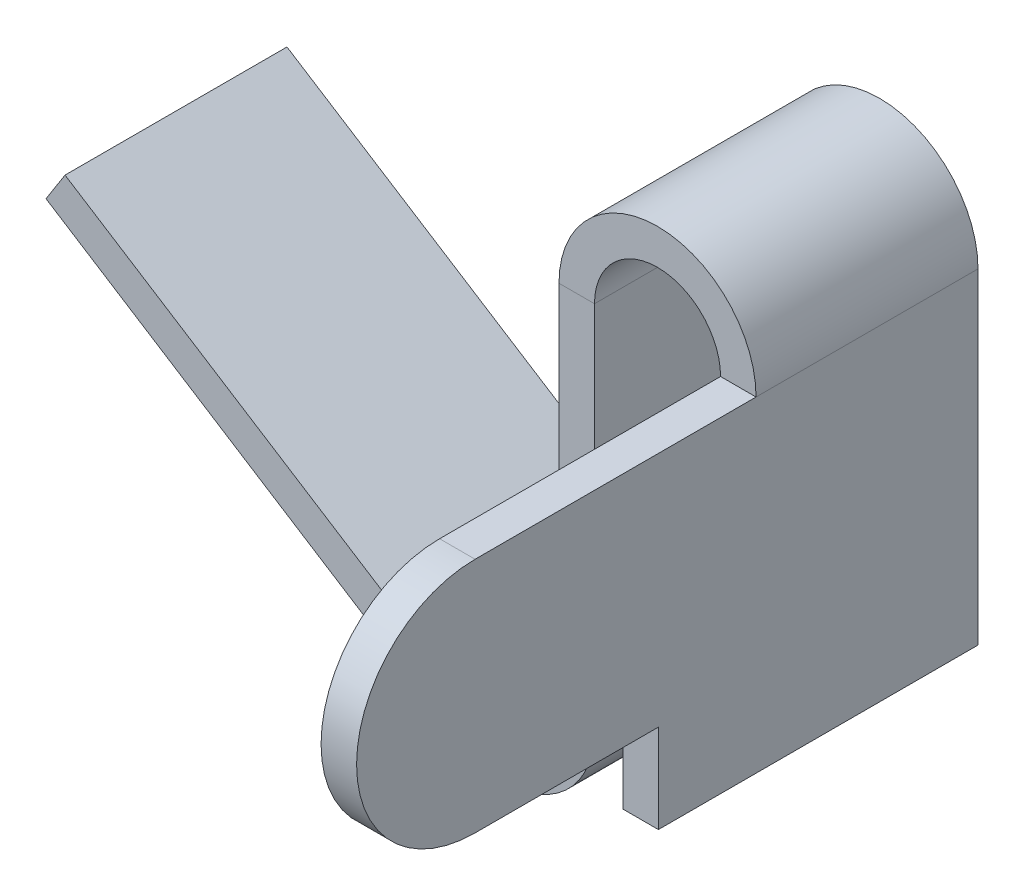
ISO-10303-21;
HEADER;
FILE_DESCRIPTION(('STEP AP214'),'2;1');
FILE_NAME('part.step','',(''),(''),'','','');
FILE_SCHEMA(('AUTOMOTIVE_DESIGN { 1 0 10303 214 1 1 1 1 }'));
ENDSEC;
DATA;
#1=APPLICATION_CONTEXT('core data for automotive mechanical design processes');
#2=APPLICATION_PROTOCOL_DEFINITION('international standard','automotive_design',2000,#1);
#3=PRODUCT_CONTEXT('',#1,'mechanical');
#4=PRODUCT('Part','Part','',(#3));
#5=PRODUCT_RELATED_PRODUCT_CATEGORY('part','',(#4));
#6=PRODUCT_DEFINITION_FORMATION('','',#4);
#7=PRODUCT_DEFINITION_CONTEXT('part definition',#1,'design');
#8=PRODUCT_DEFINITION('design','',#6,#7);
#9=PRODUCT_DEFINITION_SHAPE('','',#8);
#10=(LENGTH_UNIT() NAMED_UNIT(*) SI_UNIT(.MILLI.,.METRE.));
#11=(NAMED_UNIT(*) PLANE_ANGLE_UNIT() SI_UNIT($,.RADIAN.));
#12=(NAMED_UNIT(*) SI_UNIT($,.STERADIAN.) SOLID_ANGLE_UNIT());
#13=UNCERTAINTY_MEASURE_WITH_UNIT(LENGTH_MEASURE(1.E-05),#10,'distance_accuracy_value','');
#14=(GEOMETRIC_REPRESENTATION_CONTEXT(3) GLOBAL_UNCERTAINTY_ASSIGNED_CONTEXT((#13)) GLOBAL_UNIT_ASSIGNED_CONTEXT((#10,
#11,#12)) REPRESENTATION_CONTEXT('',''));
#15=CARTESIAN_POINT('',(0.,0.,0.));
#16=DIRECTION('',(0.,0.,1.));
#17=DIRECTION('',(1.,0.,0.));
#18=AXIS2_PLACEMENT_3D('',#15,#16,#17);
#19=CARTESIAN_POINT('',(1.11,0.5,5.665));
#20=DIRECTION('',(-1.,0.,0.));
#21=DIRECTION('',(0.,-1.,0.));
#22=AXIS2_PLACEMENT_3D('',#19,#20,#21);
#23=CYLINDRICAL_SURFACE('',#22,1.335);
#24=DIRECTION('',(1.,0.,0.));
#25=VECTOR('',#24,1.);
#26=CARTESIAN_POINT('',(1.11,-0.835,5.665));
#27=LINE('',#26,#25);
#28=CARTESIAN_POINT('',(1.11,-0.835,5.665));
#29=VERTEX_POINT('',#28);
#30=CARTESIAN_POINT('',(0.71,-0.835,5.665));
#31=VERTEX_POINT('',#30);
#32=EDGE_CURVE('E282',#29,#31,#27,.F.);
#33=ORIENTED_EDGE('',*,*,#32,.F.);
#34=CARTESIAN_POINT('',(1.11,0.5,5.665));
#35=DIRECTION('',(-1.,0.,0.));
#36=DIRECTION('',(0.,-1.,0.));
#37=AXIS2_PLACEMENT_3D('',#34,#35,#36);
#38=CIRCLE('',#37,1.335);
#39=CARTESIAN_POINT('',(1.11,1.835,5.665));
#40=VERTEX_POINT('',#39);
#41=EDGE_CURVE('E45',#40,#29,#38,.F.);
#42=ORIENTED_EDGE('',*,*,#41,.F.);
#43=DIRECTION('',(1.,0.,0.));
#44=VECTOR('',#43,1.);
#45=CARTESIAN_POINT('',(1.11,1.835,5.665));
#46=LINE('',#45,#44);
#47=CARTESIAN_POINT('',(0.71,1.835,5.665));
#48=VERTEX_POINT('',#47);
#49=EDGE_CURVE('E284',#48,#40,#46,.T.);
#50=ORIENTED_EDGE('',*,*,#49,.F.);
#51=CARTESIAN_POINT('',(0.71,0.5,5.665));
#52=DIRECTION('',(-1.,0.,0.));
#53=DIRECTION('',(0.,-1.,0.));
#54=AXIS2_PLACEMENT_3D('',#51,#52,#53);
#55=CIRCLE('',#54,1.335);
#56=EDGE_CURVE('E11',#31,#48,#55,.T.);
#57=ORIENTED_EDGE('',*,*,#56,.F.);
#58=EDGE_LOOP('',(#33,#42,#50,#57));
#59=FACE_BOUND('',#58,.T.);
#60=ADVANCED_FACE('F37',(#59),#23,.T.);
#61=CARTESIAN_POINT('',(-0.71,1.835,2.5));
#62=DIRECTION('',(0.,0.,1.));
#63=DIRECTION('',(1.,0.,0.));
#64=AXIS2_PLACEMENT_3D('',#61,#62,#63);
#65=PLANE('',#64);
#66=DIRECTION('',(-1.,0.,0.));
#67=VECTOR('',#66,1.);
#68=CARTESIAN_POINT('',(-0.71,1.835,2.5));
#69=LINE('',#68,#67);
#70=CARTESIAN_POINT('',(-0.71,1.835,2.5));
#71=VERTEX_POINT('',#70);
#72=CARTESIAN_POINT('',(-1.11,1.835,2.5));
#73=VERTEX_POINT('',#72);
#74=EDGE_CURVE('E280',#71,#73,#69,.T.);
#75=ORIENTED_EDGE('',*,*,#74,.F.);
#76=CARTESIAN_POINT('',(0.,1.835,2.5));
#77=DIRECTION('',(0.,0.,1.));
#78=DIRECTION('',(1.,0.,0.));
#79=AXIS2_PLACEMENT_3D('',#76,#77,#78);
#80=CIRCLE('',#79,0.71);
#81=CARTESIAN_POINT('',(0.71,1.835,2.5));
#82=VERTEX_POINT('',#81);
#83=EDGE_CURVE('E187',#82,#71,#80,.T.);
#84=ORIENTED_EDGE('',*,*,#83,.F.);
#85=DIRECTION('',(-1.,0.,0.));
#86=VECTOR('',#85,1.);
#87=CARTESIAN_POINT('',(1.11,1.835,2.5));
#88=LINE('',#87,#86);
#89=CARTESIAN_POINT('',(1.11,1.835,2.5));
#90=VERTEX_POINT('',#89);
#91=EDGE_CURVE('E277',#90,#82,#88,.T.);
#92=ORIENTED_EDGE('',*,*,#91,.F.);
#93=CARTESIAN_POINT('',(0.,1.835,2.5));
#94=DIRECTION('',(0.,0.,1.));
#95=DIRECTION('',(1.,0.,0.));
#96=AXIS2_PLACEMENT_3D('',#93,#94,#95);
#97=CIRCLE('',#96,1.11);
#98=EDGE_CURVE('E190',#90,#73,#97,.T.);
#99=ORIENTED_EDGE('',*,*,#98,.T.);
#100=EDGE_LOOP('',(#75,#84,#92,#99));
#101=FACE_BOUND('',#100,.T.);
#102=ADVANCED_FACE('F298',(#101),#65,.T.);
#103=CARTESIAN_POINT('',(1.11,1.835,2.5));
#104=DIRECTION('',(0.,0.,1.));
#105=DIRECTION('',(1.,0.,0.));
#106=AXIS2_PLACEMENT_3D('',#103,#104,#105);
#107=PLANE('',#106);
#108=DIRECTION('',(0.,-1.,0.));
#109=VECTOR('',#108,1.);
#110=CARTESIAN_POINT('',(-0.71,-1.835,2.5));
#111=LINE('',#110,#109);
#112=CARTESIAN_POINT('',(-0.71,-2.335,2.5));
#113=VERTEX_POINT('',#112);
#114=EDGE_CURVE('E184',#71,#113,#111,.T.);
#115=ORIENTED_EDGE('',*,*,#114,.F.);
#116=ORIENTED_EDGE('',*,*,#74,.T.);
#117=DIRECTION('',(0.,-1.,0.));
#118=VECTOR('',#117,1.);
#119=CARTESIAN_POINT('',(-1.11,-1.835,2.5));
#120=LINE('',#119,#118);
#121=CARTESIAN_POINT('',(-1.11,-2.335,2.5));
#122=VERTEX_POINT('',#121);
#123=EDGE_CURVE('E193',#73,#122,#120,.T.);
#124=ORIENTED_EDGE('',*,*,#123,.T.);
#125=DIRECTION('',(1.,0.,0.));
#126=VECTOR('',#125,1.);
#127=CARTESIAN_POINT('',(-1.11,-2.335,2.5));
#128=LINE('',#127,#126);
#129=EDGE_CURVE('E269',#122,#113,#128,.T.);
#130=ORIENTED_EDGE('',*,*,#129,.T.);
#131=EDGE_LOOP('',(#115,#116,#124,#130));
#132=FACE_BOUND('',#131,.T.);
#133=ADVANCED_FACE('F325',(#132),#107,.T.);
#134=CARTESIAN_POINT('',(0.71,1.835,0.));
#135=DIRECTION('',(0.,0.,-1.));
#136=DIRECTION('',(-1.,0.,0.));
#137=AXIS2_PLACEMENT_3D('',#134,#135,#136);
#138=PLANE('',#137);
#139=DIRECTION('',(1.,0.,0.));
#140=VECTOR('',#139,1.);
#141=CARTESIAN_POINT('',(0.71,1.835,0.));
#142=LINE('',#141,#140);
#143=CARTESIAN_POINT('',(0.71,1.835,0.));
#144=VERTEX_POINT('',#143);
#145=CARTESIAN_POINT('',(1.11,1.835,0.));
#146=VERTEX_POINT('',#145);
#147=EDGE_CURVE('E275',#144,#146,#142,.T.);
#148=ORIENTED_EDGE('',*,*,#147,.F.);
#149=CARTESIAN_POINT('',(0.,1.835,0.));
#150=DIRECTION('',(0.,0.,1.));
#151=DIRECTION('',(1.,0.,0.));
#152=AXIS2_PLACEMENT_3D('',#149,#150,#151);
#153=CIRCLE('',#152,0.71);
#154=CARTESIAN_POINT('',(-0.71,1.835,0.));
#155=VERTEX_POINT('',#154);
#156=EDGE_CURVE('E214',#144,#155,#153,.T.);
#157=ORIENTED_EDGE('',*,*,#156,.T.);
#158=DIRECTION('',(1.,0.,0.));
#159=VECTOR('',#158,1.);
#160=CARTESIAN_POINT('',(-1.11,1.835,0.));
#161=LINE('',#160,#159);
#162=CARTESIAN_POINT('',(-1.11,1.835,0.));
#163=VERTEX_POINT('',#162);
#164=EDGE_CURVE('E273',#163,#155,#161,.T.);
#165=ORIENTED_EDGE('',*,*,#164,.F.);
#166=CARTESIAN_POINT('',(0.,1.835,0.));
#167=DIRECTION('',(0.,0.,1.));
#168=DIRECTION('',(1.,0.,0.));
#169=AXIS2_PLACEMENT_3D('',#166,#167,#168);
#170=CIRCLE('',#169,1.11);
#171=EDGE_CURVE('E226',#146,#163,#170,.T.);
#172=ORIENTED_EDGE('',*,*,#171,.F.);
#173=EDGE_LOOP('',(#148,#157,#165,#172));
#174=FACE_BOUND('',#173,.T.);
#175=ADVANCED_FACE('F329',(#174),#138,.T.);
#176=CARTESIAN_POINT('',(-1.11,1.835,0.));
#177=DIRECTION('',(0.,0.,-1.));
#178=DIRECTION('',(-1.,0.,0.));
#179=AXIS2_PLACEMENT_3D('',#176,#177,#178);
#180=PLANE('',#179);
#181=DIRECTION('',(0.,1.,0.));
#182=VECTOR('',#181,1.);
#183=CARTESIAN_POINT('',(0.71,-1.835,0.));
#184=LINE('',#183,#182);
#185=CARTESIAN_POINT('',(0.71,-1.835,0.));
#186=VERTEX_POINT('',#185);
#187=EDGE_CURVE('E217',#186,#144,#184,.T.);
#188=ORIENTED_EDGE('',*,*,#187,.T.);
#189=ORIENTED_EDGE('',*,*,#147,.T.);
#190=DIRECTION('',(0.,1.,0.));
#191=VECTOR('',#190,1.);
#192=CARTESIAN_POINT('',(1.11,-1.835,0.));
#193=LINE('',#192,#191);
#194=CARTESIAN_POINT('',(1.11,-1.835,0.));
#195=VERTEX_POINT('',#194);
#196=EDGE_CURVE('E223',#195,#146,#193,.T.);
#197=ORIENTED_EDGE('',*,*,#196,.F.);
#198=DIRECTION('',(-1.,0.,0.));
#199=VECTOR('',#198,1.);
#200=CARTESIAN_POINT('',(1.11,-1.835,0.));
#201=LINE('',#200,#199);
#202=EDGE_CURVE('E220',#195,#186,#201,.T.);
#203=ORIENTED_EDGE('',*,*,#202,.T.);
#204=EDGE_LOOP('',(#188,#189,#197,#203));
#205=FACE_BOUND('',#204,.T.);
#206=ADVANCED_FACE('F310',(#205),#180,.T.);
#207=CARTESIAN_POINT('',(-2.24626881057681,-3.17904725152241,2.5));
#208=DIRECTION('',(0.,0.,1.));
#209=DIRECTION('',(1.,0.,0.));
#210=AXIS2_PLACEMENT_3D('',#207,#208,#209);
#211=PLANE('',#210);
#212=DIRECTION('',(0.536268810576813,0.844047251522407,0.));
#213=VECTOR('',#212,1.);
#214=CARTESIAN_POINT('',(-2.24626881057681,-3.17904725152241,2.5));
#215=LINE('',#214,#213);
#216=CARTESIAN_POINT('',(-2.24626881057681,-3.17904725152241,2.5));
#217=VERTEX_POINT('',#216);
#218=CARTESIAN_POINT('',(-2.03176128634609,-2.84142835091344,2.5));
#219=VERTEX_POINT('',#218);
#220=EDGE_CURVE('E271',#217,#219,#215,.T.);
#221=ORIENTED_EDGE('',*,*,#220,.F.);
#222=CARTESIAN_POINT('',(-1.71,-2.335,2.5));
#223=DIRECTION('',(0.,0.,-1.));
#224=DIRECTION('',(-1.,0.,0.));
#225=AXIS2_PLACEMENT_3D('',#222,#223,#224);
#226=CIRCLE('',#225,1.);
#227=EDGE_CURVE('E181',#113,#217,#226,.T.);
#228=ORIENTED_EDGE('',*,*,#227,.F.);
#229=ORIENTED_EDGE('',*,*,#129,.F.);
#230=CARTESIAN_POINT('',(-1.71,-2.335,2.5));
#231=DIRECTION('',(0.,0.,1.));
#232=DIRECTION('',(1.,0.,0.));
#233=AXIS2_PLACEMENT_3D('',#230,#231,#232);
#234=CIRCLE('',#233,0.6);
#235=EDGE_CURVE('E196',#122,#219,#234,.F.);
#236=ORIENTED_EDGE('',*,*,#235,.T.);
#237=EDGE_LOOP('',(#221,#228,#229,#236));
#238=FACE_BOUND('',#237,.T.);
#239=ADVANCED_FACE('F338',(#238),#211,.T.);
#240=CARTESIAN_POINT('',(-1.11,-2.335,2.5));
#241=DIRECTION('',(0.,0.,1.));
#242=DIRECTION('',(1.,0.,0.));
#243=AXIS2_PLACEMENT_3D('',#240,#241,#242);
#244=PLANE('',#243);
#245=DIRECTION('',(-0.844047251522407,0.536268810576813,0.));
#246=VECTOR('',#245,1.);
#247=CARTESIAN_POINT('',(-2.24626881057681,-3.17904725152241,2.5));
#248=LINE('',#247,#246);
#249=CARTESIAN_POINT('',(-6.88852869395005,-0.229568793349934,2.5));
#250=VERTEX_POINT('',#249);
#251=EDGE_CURVE('E178',#217,#250,#248,.T.);
#252=ORIENTED_EDGE('',*,*,#251,.F.);
#253=ORIENTED_EDGE('',*,*,#220,.T.);
#254=DIRECTION('',(-0.844047251522407,0.536268810576813,0.));
#255=VECTOR('',#254,1.);
#256=CARTESIAN_POINT('',(-2.03176128634609,-2.84142835091344,2.5));
#257=LINE('',#256,#255);
#258=CARTESIAN_POINT('',(-6.67402116971933,0.108050107259028,2.5));
#259=VERTEX_POINT('',#258);
#260=EDGE_CURVE('E172',#219,#259,#257,.T.);
#261=ORIENTED_EDGE('',*,*,#260,.T.);
#262=DIRECTION('',(0.536268810576813,0.844047251522408,0.));
#263=VECTOR('',#262,1.);
#264=CARTESIAN_POINT('',(-6.88852869395005,-0.229568793349934,2.5));
#265=LINE('',#264,#263);
#266=EDGE_CURVE('E174',#250,#259,#265,.T.);
#267=ORIENTED_EDGE('',*,*,#266,.F.);
#268=EDGE_LOOP('',(#252,#253,#261,#267));
#269=FACE_BOUND('',#268,.T.);
#270=ADVANCED_FACE('F341',(#269),#244,.T.);
#271=CARTESIAN_POINT('',(-0.71,-2.335,0.));
#272=DIRECTION('',(0.,0.,-1.));
#273=DIRECTION('',(-1.,0.,0.));
#274=AXIS2_PLACEMENT_3D('',#271,#272,#273);
#275=PLANE('',#274);
#276=DIRECTION('',(-1.,0.,0.));
#277=VECTOR('',#276,1.);
#278=CARTESIAN_POINT('',(-0.71,-2.335,0.));
#279=LINE('',#278,#277);
#280=CARTESIAN_POINT('',(-0.71,-2.335,0.));
#281=VERTEX_POINT('',#280);
#282=CARTESIAN_POINT('',(-1.11,-2.335,0.));
#283=VERTEX_POINT('',#282);
#284=EDGE_CURVE('E267',#281,#283,#279,.T.);
#285=ORIENTED_EDGE('',*,*,#284,.F.);
#286=CARTESIAN_POINT('',(-1.71,-2.335,0.));
#287=DIRECTION('',(0.,0.,-1.));
#288=DIRECTION('',(-1.,0.,0.));
#289=AXIS2_PLACEMENT_3D('',#286,#287,#288);
#290=CIRCLE('',#289,1.);
#291=CARTESIAN_POINT('',(-2.24626881057681,-3.17904725152241,0.));
#292=VERTEX_POINT('',#291);
#293=EDGE_CURVE('E208',#281,#292,#290,.T.);
#294=ORIENTED_EDGE('',*,*,#293,.T.);
#295=DIRECTION('',(-0.536268810576813,-0.844047251522407,0.));
#296=VECTOR('',#295,1.);
#297=CARTESIAN_POINT('',(-2.03176128634609,-2.84142835091344,0.));
#298=LINE('',#297,#296);
#299=CARTESIAN_POINT('',(-2.03176128634609,-2.84142835091344,0.));
#300=VERTEX_POINT('',#299);
#301=EDGE_CURVE('E265',#300,#292,#298,.T.);
#302=ORIENTED_EDGE('',*,*,#301,.F.);
#303=CARTESIAN_POINT('',(-1.71,-2.335,0.));
#304=DIRECTION('',(0.,0.,1.));
#305=DIRECTION('',(1.,0.,0.));
#306=AXIS2_PLACEMENT_3D('',#303,#304,#305);
#307=CIRCLE('',#306,0.6);
#308=EDGE_CURVE('E175',#283,#300,#307,.F.);
#309=ORIENTED_EDGE('',*,*,#308,.F.);
#310=EDGE_LOOP('',(#285,#294,#302,#309));
#311=FACE_BOUND('',#310,.T.);
#312=ADVANCED_FACE('F345',(#311),#275,.T.);
#313=CARTESIAN_POINT('',(-2.03176128634609,-2.84142835091344,0.));
#314=DIRECTION('',(0.,0.,-1.));
#315=DIRECTION('',(-1.,0.,0.));
#316=AXIS2_PLACEMENT_3D('',#313,#314,#315);
#317=PLANE('',#316);
#318=DIRECTION('',(0.,-1.,0.));
#319=VECTOR('',#318,1.);
#320=CARTESIAN_POINT('',(-0.71,-1.835,0.));
#321=LINE('',#320,#319);
#322=EDGE_CURVE('E211',#155,#281,#321,.T.);
#323=ORIENTED_EDGE('',*,*,#322,.T.);
#324=ORIENTED_EDGE('',*,*,#284,.T.);
#325=DIRECTION('',(0.,1.,0.));
#326=VECTOR('',#325,1.);
#327=CARTESIAN_POINT('',(-1.11,-1.835,0.));
#328=LINE('',#327,#326);
#329=EDGE_CURVE('E229',#163,#283,#328,.F.);
#330=ORIENTED_EDGE('',*,*,#329,.F.);
#331=ORIENTED_EDGE('',*,*,#164,.T.);
#332=EDGE_LOOP('',(#323,#324,#330,#331));
#333=FACE_BOUND('',#332,.T.);
#334=ADVANCED_FACE('F349',(#333),#317,.T.);
#335=CARTESIAN_POINT('',(-2.03176128634609,-2.84142835091344,2.5));
#336=DIRECTION('',(-0.536268810576813,-0.844047251522407,0.));
#337=DIRECTION('',(0.844047251522407,-0.536268810576813,0.));
#338=AXIS2_PLACEMENT_3D('',#335,#336,#337);
#339=PLANE('',#338);
#340=DIRECTION('',(-0.844047251522407,0.536268810576813,0.));
#341=VECTOR('',#340,1.);
#342=CARTESIAN_POINT('',(-2.03176128634609,-2.84142835091344,0.));
#343=LINE('',#342,#341);
#344=CARTESIAN_POINT('',(-6.67402116971933,0.108050107259028,0.));
#345=VERTEX_POINT('',#344);
#346=EDGE_CURVE('E171',#300,#345,#343,.T.);
#347=ORIENTED_EDGE('',*,*,#346,.T.);
#348=DIRECTION('',(0.,0.,-1.));
#349=VECTOR('',#348,1.);
#350=CARTESIAN_POINT('',(-6.67402116971933,0.108050107259028,2.5));
#351=LINE('',#350,#349);
#352=EDGE_CURVE('E263',#259,#345,#351,.T.);
#353=ORIENTED_EDGE('',*,*,#352,.F.);
#354=ORIENTED_EDGE('',*,*,#260,.F.);
#355=DIRECTION('',(0.,0.,-1.));
#356=VECTOR('',#355,1.);
#357=CARTESIAN_POINT('',(-2.03176128634609,-2.84142835091344,2.5));
#358=LINE('',#357,#356);
#359=EDGE_CURVE('E199',#219,#300,#358,.T.);
#360=ORIENTED_EDGE('',*,*,#359,.T.);
#361=EDGE_LOOP('',(#347,#353,#354,#360));
#362=FACE_BOUND('',#361,.T.);
#363=ADVANCED_FACE('F353',(#362),#339,.F.);
#364=CARTESIAN_POINT('',(-6.88852869395005,-0.229568793349934,2.5));
#365=DIRECTION('',(-0.844047251522408,0.536268810576813,0.));
#366=DIRECTION('',(-0.536268810576813,-0.844047251522408,0.));
#367=AXIS2_PLACEMENT_3D('',#364,#365,#366);
#368=PLANE('',#367);
#369=DIRECTION('',(0.536268810576813,0.844047251522408,0.));
#370=VECTOR('',#369,1.);
#371=CARTESIAN_POINT('',(-6.88852869395005,-0.229568793349934,0.));
#372=LINE('',#371,#370);
#373=CARTESIAN_POINT('',(-6.88852869395005,-0.229568793349934,0.));
#374=VERTEX_POINT('',#373);
#375=EDGE_CURVE('E202',#374,#345,#372,.T.);
#376=ORIENTED_EDGE('',*,*,#375,.F.);
#377=DIRECTION('',(0.,0.,-1.));
#378=VECTOR('',#377,1.);
#379=CARTESIAN_POINT('',(-6.88852869395005,-0.229568793349934,2.5));
#380=LINE('',#379,#378);
#381=EDGE_CURVE('E261',#250,#374,#380,.T.);
#382=ORIENTED_EDGE('',*,*,#381,.F.);
#383=ORIENTED_EDGE('',*,*,#266,.T.);
#384=ORIENTED_EDGE('',*,*,#352,.T.);
#385=EDGE_LOOP('',(#376,#382,#383,#384));
#386=FACE_BOUND('',#385,.T.);
#387=ADVANCED_FACE('F357',(#386),#368,.T.);
#388=CARTESIAN_POINT('',(-2.24626881057681,-3.17904725152241,2.5));
#389=DIRECTION('',(-0.536268810576813,-0.844047251522407,0.));
#390=DIRECTION('',(0.844047251522407,-0.536268810576813,0.));
#391=AXIS2_PLACEMENT_3D('',#388,#389,#390);
#392=PLANE('',#391);
#393=DIRECTION('',(-0.844047251522407,0.536268810576813,0.));
#394=VECTOR('',#393,1.);
#395=CARTESIAN_POINT('',(-2.24626881057681,-3.17904725152241,0.));
#396=LINE('',#395,#394);
#397=EDGE_CURVE('E205',#292,#374,#396,.T.);
#398=ORIENTED_EDGE('',*,*,#397,.F.);
#399=DIRECTION('',(0.,0.,-1.));
#400=VECTOR('',#399,1.);
#401=CARTESIAN_POINT('',(-2.24626881057681,-3.17904725152241,2.5));
#402=LINE('',#401,#400);
#403=EDGE_CURVE('E258',#217,#292,#402,.T.);
#404=ORIENTED_EDGE('',*,*,#403,.F.);
#405=ORIENTED_EDGE('',*,*,#251,.T.);
#406=ORIENTED_EDGE('',*,*,#381,.T.);
#407=EDGE_LOOP('',(#398,#404,#405,#406));
#408=FACE_BOUND('',#407,.T.);
#409=ADVANCED_FACE('F361',(#408),#392,.T.);
#410=CARTESIAN_POINT('',(-1.71,-2.335,2.5));
#411=DIRECTION('',(0.,0.,-1.));
#412=DIRECTION('',(-1.,0.,0.));
#413=AXIS2_PLACEMENT_3D('',#410,#411,#412);
#414=CYLINDRICAL_SURFACE('',#413,1.);
#415=ORIENTED_EDGE('',*,*,#293,.F.);
#416=DIRECTION('',(0.,0.,-1.));
#417=VECTOR('',#416,1.);
#418=CARTESIAN_POINT('',(-0.71,-2.335,2.5));
#419=LINE('',#418,#417);
#420=EDGE_CURVE('E255',#113,#281,#419,.T.);
#421=ORIENTED_EDGE('',*,*,#420,.F.);
#422=ORIENTED_EDGE('',*,*,#227,.T.);
#423=ORIENTED_EDGE('',*,*,#403,.T.);
#424=EDGE_LOOP('',(#415,#421,#422,#423));
#425=FACE_BOUND('',#424,.T.);
#426=ADVANCED_FACE('F365',(#425),#414,.T.);
#427=CARTESIAN_POINT('',(-0.71,-1.835,2.5));
#428=DIRECTION('',(1.,0.,0.));
#429=DIRECTION('',(0.,1.,0.));
#430=AXIS2_PLACEMENT_3D('',#427,#428,#429);
#431=PLANE('',#430);
#432=ORIENTED_EDGE('',*,*,#322,.F.);
#433=DIRECTION('',(0.,0.,-1.));
#434=VECTOR('',#433,1.);
#435=CARTESIAN_POINT('',(-0.71,1.835,2.5));
#436=LINE('',#435,#434);
#437=EDGE_CURVE('E252',#71,#155,#436,.T.);
#438=ORIENTED_EDGE('',*,*,#437,.F.);
#439=ORIENTED_EDGE('',*,*,#114,.T.);
#440=ORIENTED_EDGE('',*,*,#420,.T.);
#441=EDGE_LOOP('',(#432,#438,#439,#440));
#442=FACE_BOUND('',#441,.T.);
#443=ADVANCED_FACE('F369',(#442),#431,.T.);
#444=CARTESIAN_POINT('',(0.,1.835,2.5));
#445=DIRECTION('',(0.,0.,-1.));
#446=DIRECTION('',(-1.,0.,0.));
#447=AXIS2_PLACEMENT_3D('',#444,#445,#446);
#448=CYLINDRICAL_SURFACE('',#447,0.71);
#449=ORIENTED_EDGE('',*,*,#156,.F.);
#450=DIRECTION('',(0.,0.,-1.));
#451=VECTOR('',#450,1.);
#452=CARTESIAN_POINT('',(0.71,1.835,2.5));
#453=LINE('',#452,#451);
#454=EDGE_CURVE('E249',#82,#144,#453,.T.);
#455=ORIENTED_EDGE('',*,*,#454,.F.);
#456=ORIENTED_EDGE('',*,*,#83,.T.);
#457=ORIENTED_EDGE('',*,*,#437,.T.);
#458=EDGE_LOOP('',(#449,#455,#456,#457));
#459=FACE_BOUND('',#458,.T.);
#460=ADVANCED_FACE('F304',(#459),#448,.F.);
#461=CARTESIAN_POINT('',(0.71,-1.835,2.5));
#462=DIRECTION('',(-1.,0.,0.));
#463=DIRECTION('',(0.,-1.,0.));
#464=AXIS2_PLACEMENT_3D('',#461,#462,#463);
#465=PLANE('',#464);
#466=DIRECTION('',(0.,0.,-1.));
#467=VECTOR('',#466,1.);
#468=CARTESIAN_POINT('',(0.71,-0.835,2.5));
#469=LINE('',#468,#467);
#470=CARTESIAN_POINT('',(0.71,-0.835,3.6));
#471=VERTEX_POINT('',#470);
#472=EDGE_CURVE('E147',#31,#471,#469,.T.);
#473=ORIENTED_EDGE('',*,*,#472,.F.);
#474=ORIENTED_EDGE('',*,*,#56,.T.);
#475=DIRECTION('',(0.,0.,-1.));
#476=VECTOR('',#475,1.);
#477=CARTESIAN_POINT('',(0.71,1.835,7.));
#478=LINE('',#477,#476);
#479=EDGE_CURVE('E167',#48,#82,#478,.T.);
#480=ORIENTED_EDGE('',*,*,#479,.T.);
#481=ORIENTED_EDGE('',*,*,#454,.T.);
#482=ORIENTED_EDGE('',*,*,#187,.F.);
#483=DIRECTION('',(0.,0.,-1.));
#484=VECTOR('',#483,1.);
#485=CARTESIAN_POINT('',(0.71,-1.835,2.5));
#486=LINE('',#485,#484);
#487=CARTESIAN_POINT('',(0.710000000000001,-1.835,3.6));
#488=VERTEX_POINT('',#487);
#489=EDGE_CURVE('E247',#488,#186,#486,.T.);
#490=ORIENTED_EDGE('',*,*,#489,.F.);
#491=DIRECTION('',(0.,-1.,0.));
#492=VECTOR('',#491,1.);
#493=CARTESIAN_POINT('',(0.71,-1.835,3.6));
#494=LINE('',#493,#492);
#495=EDGE_CURVE('E165',#471,#488,#494,.T.);
#496=ORIENTED_EDGE('',*,*,#495,.F.);
#497=EDGE_LOOP('',(#473,#474,#480,#481,#482,#490,#496));
#498=FACE_BOUND('',#497,.T.);
#499=ADVANCED_FACE('F306',(#498),#465,.T.);
#500=CARTESIAN_POINT('',(1.11,-1.835,2.5));
#501=DIRECTION('',(0.,-1.,0.));
#502=DIRECTION('',(0.,0.,-1.));
#503=AXIS2_PLACEMENT_3D('',#500,#501,#502);
#504=PLANE('',#503);
#505=DIRECTION('',(1.,0.,0.));
#506=VECTOR('',#505,1.);
#507=CARTESIAN_POINT('',(-6.88852869395005,-1.835,3.6));
#508=LINE('',#507,#506);
#509=CARTESIAN_POINT('',(1.11,-1.835,3.6));
#510=VERTEX_POINT('',#509);
#511=EDGE_CURVE('E150',#488,#510,#508,.T.);
#512=ORIENTED_EDGE('',*,*,#511,.F.);
#513=ORIENTED_EDGE('',*,*,#489,.T.);
#514=ORIENTED_EDGE('',*,*,#202,.F.);
#515=DIRECTION('',(0.,0.,-1.));
#516=VECTOR('',#515,1.);
#517=CARTESIAN_POINT('',(1.11,-1.835,2.5));
#518=LINE('',#517,#516);
#519=EDGE_CURVE('E245',#510,#195,#518,.T.);
#520=ORIENTED_EDGE('',*,*,#519,.F.);
#521=EDGE_LOOP('',(#512,#513,#514,#520));
#522=FACE_BOUND('',#521,.T.);
#523=ADVANCED_FACE('F312',(#522),#504,.T.);
#524=CARTESIAN_POINT('',(1.11,-1.835,2.5));
#525=DIRECTION('',(-1.,0.,0.));
#526=DIRECTION('',(0.,-1.,0.));
#527=AXIS2_PLACEMENT_3D('',#524,#525,#526);
#528=PLANE('',#527);
#529=DIRECTION('',(0.,0.,-1.));
#530=VECTOR('',#529,1.);
#531=CARTESIAN_POINT('',(1.11,1.835,7.));
#532=LINE('',#531,#530);
#533=EDGE_CURVE('E169',#40,#90,#532,.T.);
#534=ORIENTED_EDGE('',*,*,#533,.F.);
#535=ORIENTED_EDGE('',*,*,#41,.T.);
#536=DIRECTION('',(0.,0.,1.));
#537=VECTOR('',#536,1.);
#538=CARTESIAN_POINT('',(1.11,-0.835,7.));
#539=LINE('',#538,#537);
#540=CARTESIAN_POINT('',(1.11,-0.835,3.6));
#541=VERTEX_POINT('',#540);
#542=EDGE_CURVE('E146',#541,#29,#539,.T.);
#543=ORIENTED_EDGE('',*,*,#542,.F.);
#544=DIRECTION('',(0.,1.,0.));
#545=VECTOR('',#544,1.);
#546=CARTESIAN_POINT('',(1.11,-0.835,3.6));
#547=LINE('',#546,#545);
#548=EDGE_CURVE('E153',#510,#541,#547,.T.);
#549=ORIENTED_EDGE('',*,*,#548,.F.);
#550=ORIENTED_EDGE('',*,*,#519,.T.);
#551=ORIENTED_EDGE('',*,*,#196,.T.);
#552=DIRECTION('',(0.,0.,-1.));
#553=VECTOR('',#552,1.);
#554=CARTESIAN_POINT('',(1.11,1.835,2.5));
#555=LINE('',#554,#553);
#556=EDGE_CURVE('E242',#90,#146,#555,.T.);
#557=ORIENTED_EDGE('',*,*,#556,.F.);
#558=EDGE_LOOP('',(#534,#535,#543,#549,#550,#551,#557));
#559=FACE_BOUND('',#558,.T.);
#560=ADVANCED_FACE('F160',(#559),#528,.F.);
#561=CARTESIAN_POINT('',(0.,1.835,2.5));
#562=DIRECTION('',(0.,0.,-1.));
#563=DIRECTION('',(-1.,0.,0.));
#564=AXIS2_PLACEMENT_3D('',#561,#562,#563);
#565=CYLINDRICAL_SURFACE('',#564,1.11);
#566=ORIENTED_EDGE('',*,*,#171,.T.);
#567=DIRECTION('',(0.,0.,-1.));
#568=VECTOR('',#567,1.);
#569=CARTESIAN_POINT('',(-1.11,1.835,2.5));
#570=LINE('',#569,#568);
#571=EDGE_CURVE('E239',#73,#163,#570,.T.);
#572=ORIENTED_EDGE('',*,*,#571,.F.);
#573=ORIENTED_EDGE('',*,*,#98,.F.);
#574=ORIENTED_EDGE('',*,*,#556,.T.);
#575=EDGE_LOOP('',(#566,#572,#573,#574));
#576=FACE_BOUND('',#575,.T.);
#577=ADVANCED_FACE('F295',(#576),#565,.T.);
#578=CARTESIAN_POINT('',(-1.11,-1.835,2.5));
#579=DIRECTION('',(1.,0.,0.));
#580=DIRECTION('',(0.,0.,-1.));
#581=AXIS2_PLACEMENT_3D('',#578,#579,#580);
#582=PLANE('',#581);
#583=ORIENTED_EDGE('',*,*,#329,.T.);
#584=DIRECTION('',(0.,0.,-1.));
#585=VECTOR('',#584,1.);
#586=CARTESIAN_POINT('',(-1.11,-2.335,2.5));
#587=LINE('',#586,#585);
#588=EDGE_CURVE('E236',#122,#283,#587,.T.);
#589=ORIENTED_EDGE('',*,*,#588,.F.);
#590=ORIENTED_EDGE('',*,*,#123,.F.);
#591=ORIENTED_EDGE('',*,*,#571,.T.);
#592=EDGE_LOOP('',(#583,#589,#590,#591));
#593=FACE_BOUND('',#592,.T.);
#594=ADVANCED_FACE('F435',(#593),#582,.F.);
#595=CARTESIAN_POINT('',(-1.71,-2.335,2.5));
#596=DIRECTION('',(0.,0.,-1.));
#597=DIRECTION('',(-1.,0.,0.));
#598=AXIS2_PLACEMENT_3D('',#595,#596,#597);
#599=CYLINDRICAL_SURFACE('',#598,0.6);
#600=ORIENTED_EDGE('',*,*,#308,.T.);
#601=ORIENTED_EDGE('',*,*,#359,.F.);
#602=ORIENTED_EDGE('',*,*,#235,.F.);
#603=ORIENTED_EDGE('',*,*,#588,.T.);
#604=EDGE_LOOP('',(#600,#601,#602,#603));
#605=FACE_BOUND('',#604,.T.);
#606=ADVANCED_FACE('F446',(#605),#599,.F.);
#607=CARTESIAN_POINT('',(-1.71,-2.335,0.));
#608=DIRECTION('',(0.,0.,-1.));
#609=DIRECTION('',(-1.,0.,0.));
#610=AXIS2_PLACEMENT_3D('',#607,#608,#609);
#611=PLANE('',#610);
#612=ORIENTED_EDGE('',*,*,#346,.F.);
#613=ORIENTED_EDGE('',*,*,#301,.T.);
#614=ORIENTED_EDGE('',*,*,#397,.T.);
#615=ORIENTED_EDGE('',*,*,#375,.T.);
#616=EDGE_LOOP('',(#612,#613,#614,#615));
#617=FACE_BOUND('',#616,.T.);
#618=ADVANCED_FACE('F407',(#617),#611,.T.);
#619=CARTESIAN_POINT('',(1.11,1.835,7.));
#620=DIRECTION('',(0.,-1.,0.));
#621=DIRECTION('',(0.,0.,-1.));
#622=AXIS2_PLACEMENT_3D('',#619,#620,#621);
#623=PLANE('',#622);
#624=ORIENTED_EDGE('',*,*,#479,.F.);
#625=ORIENTED_EDGE('',*,*,#49,.T.);
#626=ORIENTED_EDGE('',*,*,#533,.T.);
#627=ORIENTED_EDGE('',*,*,#91,.T.);
#628=EDGE_LOOP('',(#624,#625,#626,#627));
#629=FACE_BOUND('',#628,.T.);
#630=ADVANCED_FACE('F287',(#629),#623,.F.);
#631=CARTESIAN_POINT('',(-6.88852869395005,-0.835000000000001,3.6));
#632=DIRECTION('',(0.,0.,-1.));
#633=DIRECTION('',(-1.,0.,0.));
#634=AXIS2_PLACEMENT_3D('',#631,#632,#633);
#635=PLANE('',#634);
#636=ORIENTED_EDGE('',*,*,#495,.T.);
#637=ORIENTED_EDGE('',*,*,#511,.T.);
#638=ORIENTED_EDGE('',*,*,#548,.T.);
#639=DIRECTION('',(1.,0.,0.));
#640=VECTOR('',#639,1.);
#641=CARTESIAN_POINT('',(-6.88852869395005,-0.835000000000001,3.6));
#642=LINE('',#641,#640);
#643=EDGE_CURVE('E141',#471,#541,#642,.T.);
#644=ORIENTED_EDGE('',*,*,#643,.F.);
#645=EDGE_LOOP('',(#636,#637,#638,#644));
#646=FACE_BOUND('',#645,.T.);
#647=ADVANCED_FACE('F154',(#646),#635,.F.);
#648=CARTESIAN_POINT('',(-6.88852869395005,-0.835000000000001,7.));
#649=DIRECTION('',(0.,1.,0.));
#650=DIRECTION('',(-1.,0.,0.));
#651=AXIS2_PLACEMENT_3D('',#648,#649,#650);
#652=PLANE('',#651);
#653=ORIENTED_EDGE('',*,*,#542,.T.);
#654=ORIENTED_EDGE('',*,*,#32,.T.);
#655=ORIENTED_EDGE('',*,*,#472,.T.);
#656=ORIENTED_EDGE('',*,*,#643,.T.);
#657=EDGE_LOOP('',(#653,#654,#655,#656));
#658=FACE_BOUND('',#657,.T.);
#659=ADVANCED_FACE('F143',(#658),#652,.F.);
#660=CLOSED_SHELL('',(#60,#102,#133,#175,#206,#239,#270,#312,#334,#363,#387,#409,#426,#443,#460,
#499,#523,#560,#577,#594,#606,#618,#630,#647,#659));
#661=MANIFOLD_SOLID_BREP('B2',#660);
#662=ADVANCED_BREP_SHAPE_REPRESENTATION('',(#18,#661),#14);
#663=SHAPE_DEFINITION_REPRESENTATION(#9,#662);
ENDSEC;
END-ISO-10303-21;
